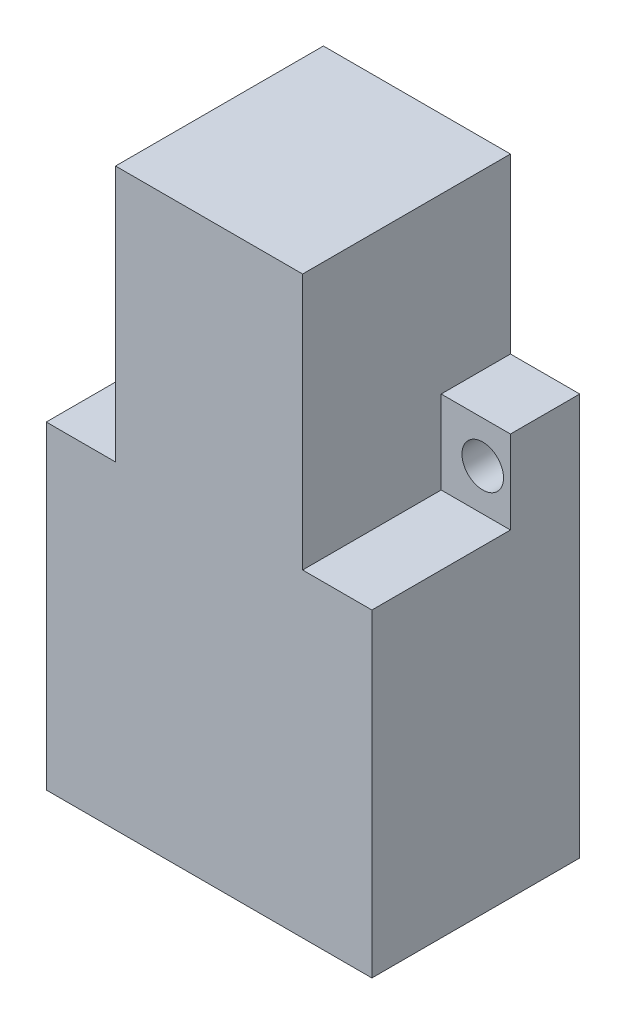
ISO-10303-21;
HEADER;
FILE_DESCRIPTION(('STEP AP214'),'2;1');
FILE_NAME('part.step','',(''),(''),'','','');
FILE_SCHEMA(('AUTOMOTIVE_DESIGN { 1 0 10303 214 1 1 1 1 }'));
ENDSEC;
DATA;
#1=APPLICATION_CONTEXT('core data for automotive mechanical design processes');
#2=APPLICATION_PROTOCOL_DEFINITION('international standard','automotive_design',2000,#1);
#3=PRODUCT_CONTEXT('',#1,'mechanical');
#4=PRODUCT('Part','Part','',(#3));
#5=PRODUCT_RELATED_PRODUCT_CATEGORY('part','',(#4));
#6=PRODUCT_DEFINITION_FORMATION('','',#4);
#7=PRODUCT_DEFINITION_CONTEXT('part definition',#1,'design');
#8=PRODUCT_DEFINITION('design','',#6,#7);
#9=PRODUCT_DEFINITION_SHAPE('','',#8);
#10=(LENGTH_UNIT() NAMED_UNIT(*) SI_UNIT(.MILLI.,.METRE.));
#11=(NAMED_UNIT(*) PLANE_ANGLE_UNIT() SI_UNIT($,.RADIAN.));
#12=(NAMED_UNIT(*) SI_UNIT($,.STERADIAN.) SOLID_ANGLE_UNIT());
#13=UNCERTAINTY_MEASURE_WITH_UNIT(LENGTH_MEASURE(1.E-05),#10,'distance_accuracy_value','');
#14=(GEOMETRIC_REPRESENTATION_CONTEXT(3) GLOBAL_UNCERTAINTY_ASSIGNED_CONTEXT((#13)) GLOBAL_UNIT_ASSIGNED_CONTEXT((#10,
#11,#12)) REPRESENTATION_CONTEXT('',''));
#15=CARTESIAN_POINT('',(0.,0.,0.));
#16=DIRECTION('',(0.,0.,1.));
#17=DIRECTION('',(1.,0.,0.));
#18=AXIS2_PLACEMENT_3D('',#15,#16,#17);
#19=CARTESIAN_POINT('',(11.75,20.75,15.));
#20=DIRECTION('',(-1.,0.,0.));
#21=DIRECTION('',(0.,-1.,0.));
#22=AXIS2_PLACEMENT_3D('',#19,#20,#21);
#23=PLANE('',#22);
#24=DIRECTION('',(0.,1.,0.));
#25=VECTOR('',#24,1.);
#26=CARTESIAN_POINT('',(11.75,20.75,0.));
#27=LINE('',#26,#25);
#28=CARTESIAN_POINT('',(11.75,-20.75,0.));
#29=VERTEX_POINT('',#28);
#30=CARTESIAN_POINT('',(11.75,8.25000000000001,0.));
#31=VERTEX_POINT('',#30);
#32=EDGE_CURVE('E148',#29,#31,#27,.T.);
#33=ORIENTED_EDGE('',*,*,#32,.T.);
#34=DIRECTION('',(0.,0.,1.));
#35=VECTOR('',#34,1.);
#36=CARTESIAN_POINT('',(11.75,8.25000000000001,0.));
#37=LINE('',#36,#35);
#38=CARTESIAN_POINT('',(11.75,8.25000000000001,5.));
#39=VERTEX_POINT('',#38);
#40=EDGE_CURVE('E224',#31,#39,#37,.T.);
#41=ORIENTED_EDGE('',*,*,#40,.T.);
#42=DIRECTION('',(0.,1.,0.));
#43=VECTOR('',#42,1.);
#44=CARTESIAN_POINT('',(11.75,20.75,5.));
#45=LINE('',#44,#43);
#46=CARTESIAN_POINT('',(11.75,2.25000000000001,5.));
#47=VERTEX_POINT('',#46);
#48=EDGE_CURVE('E181',#47,#39,#45,.T.);
#49=ORIENTED_EDGE('',*,*,#48,.F.);
#50=DIRECTION('',(0.,0.,1.));
#51=VECTOR('',#50,1.);
#52=CARTESIAN_POINT('',(11.75,2.25000000000001,5.));
#53=LINE('',#52,#51);
#54=CARTESIAN_POINT('',(11.75,2.25000000000001,15.));
#55=VERTEX_POINT('',#54);
#56=EDGE_CURVE('E195',#47,#55,#53,.T.);
#57=ORIENTED_EDGE('',*,*,#56,.T.);
#58=DIRECTION('',(0.,1.,0.));
#59=VECTOR('',#58,1.);
#60=CARTESIAN_POINT('',(11.75,20.75,15.));
#61=LINE('',#60,#59);
#62=CARTESIAN_POINT('',(11.75,-20.75,15.));
#63=VERTEX_POINT('',#62);
#64=EDGE_CURVE('E145',#63,#55,#61,.T.);
#65=ORIENTED_EDGE('',*,*,#64,.F.);
#66=DIRECTION('',(0.,0.,-1.));
#67=VECTOR('',#66,1.);
#68=CARTESIAN_POINT('',(11.75,-20.75,15.));
#69=LINE('',#68,#67);
#70=EDGE_CURVE('E41',#63,#29,#69,.T.);
#71=ORIENTED_EDGE('',*,*,#70,.T.);
#72=EDGE_LOOP('',(#33,#41,#49,#57,#65,#71));
#73=FACE_BOUND('',#72,.T.);
#74=ADVANCED_FACE('F34',(#73),#23,.F.);
#75=CARTESIAN_POINT('',(-11.75,20.75,15.));
#76=DIRECTION('',(0.,-1.,0.));
#77=DIRECTION('',(0.,0.,-1.));
#78=AXIS2_PLACEMENT_3D('',#75,#76,#77);
#79=PLANE('',#78);
#80=DIRECTION('',(-1.,0.,0.));
#81=VECTOR('',#80,1.);
#82=CARTESIAN_POINT('',(-11.75,20.75,0.));
#83=LINE('',#82,#81);
#84=CARTESIAN_POINT('',(6.75,20.75,0.));
#85=VERTEX_POINT('',#84);
#86=CARTESIAN_POINT('',(-6.75,20.75,0.));
#87=VERTEX_POINT('',#86);
#88=EDGE_CURVE('E143',#85,#87,#83,.T.);
#89=ORIENTED_EDGE('',*,*,#88,.T.);
#90=DIRECTION('',(0.,0.,1.));
#91=VECTOR('',#90,1.);
#92=CARTESIAN_POINT('',(-6.75,20.75,5.));
#93=LINE('',#92,#91);
#94=CARTESIAN_POINT('',(-6.75,20.75,15.));
#95=VERTEX_POINT('',#94);
#96=EDGE_CURVE('E165',#87,#95,#93,.T.);
#97=ORIENTED_EDGE('',*,*,#96,.T.);
#98=DIRECTION('',(-1.,0.,0.));
#99=VECTOR('',#98,1.);
#100=CARTESIAN_POINT('',(-11.75,20.75,15.));
#101=LINE('',#100,#99);
#102=CARTESIAN_POINT('',(6.75,20.75,15.));
#103=VERTEX_POINT('',#102);
#104=EDGE_CURVE('E162',#103,#95,#101,.T.);
#105=ORIENTED_EDGE('',*,*,#104,.F.);
#106=DIRECTION('',(0.,0.,1.));
#107=VECTOR('',#106,1.);
#108=CARTESIAN_POINT('',(6.75,20.75,5.));
#109=LINE('',#108,#107);
#110=EDGE_CURVE('E190',#85,#103,#109,.T.);
#111=ORIENTED_EDGE('',*,*,#110,.F.);
#112=EDGE_LOOP('',(#89,#97,#105,#111));
#113=FACE_BOUND('',#112,.T.);
#114=ADVANCED_FACE('F207',(#113),#79,.F.);
#115=CARTESIAN_POINT('',(-11.75,20.75,15.));
#116=DIRECTION('',(1.,0.,0.));
#117=DIRECTION('',(0.,0.,-1.));
#118=AXIS2_PLACEMENT_3D('',#115,#116,#117);
#119=PLANE('',#118);
#120=DIRECTION('',(0.,-1.,0.));
#121=VECTOR('',#120,1.);
#122=CARTESIAN_POINT('',(-11.75,20.75,5.));
#123=LINE('',#122,#121);
#124=CARTESIAN_POINT('',(-11.75,8.25000000000001,5.));
#125=VERTEX_POINT('',#124);
#126=CARTESIAN_POINT('',(-11.75,2.25000000000001,5.));
#127=VERTEX_POINT('',#126);
#128=EDGE_CURVE('E137',#125,#127,#123,.T.);
#129=ORIENTED_EDGE('',*,*,#128,.F.);
#130=DIRECTION('',(0.,0.,1.));
#131=VECTOR('',#130,1.);
#132=CARTESIAN_POINT('',(-11.75,8.25000000000001,0.));
#133=LINE('',#132,#131);
#134=CARTESIAN_POINT('',(-11.75,8.25000000000001,0.));
#135=VERTEX_POINT('',#134);
#136=EDGE_CURVE('E56',#135,#125,#133,.T.);
#137=ORIENTED_EDGE('',*,*,#136,.F.);
#138=DIRECTION('',(0.,-1.,0.));
#139=VECTOR('',#138,1.);
#140=CARTESIAN_POINT('',(-11.75,20.75,0.));
#141=LINE('',#140,#139);
#142=CARTESIAN_POINT('',(-11.75,-20.75,0.));
#143=VERTEX_POINT('',#142);
#144=EDGE_CURVE('E135',#135,#143,#141,.T.);
#145=ORIENTED_EDGE('',*,*,#144,.T.);
#146=DIRECTION('',(0.,0.,-1.));
#147=VECTOR('',#146,1.);
#148=CARTESIAN_POINT('',(-11.75,-20.75,15.));
#149=LINE('',#148,#147);
#150=CARTESIAN_POINT('',(-11.75,-20.75,15.));
#151=VERTEX_POINT('',#150);
#152=EDGE_CURVE('E11',#151,#143,#149,.T.);
#153=ORIENTED_EDGE('',*,*,#152,.F.);
#154=DIRECTION('',(0.,-1.,0.));
#155=VECTOR('',#154,1.);
#156=CARTESIAN_POINT('',(-11.75,20.75,15.));
#157=LINE('',#156,#155);
#158=CARTESIAN_POINT('',(-11.75,2.25000000000001,15.));
#159=VERTEX_POINT('',#158);
#160=EDGE_CURVE('E157',#159,#151,#157,.T.);
#161=ORIENTED_EDGE('',*,*,#160,.F.);
#162=DIRECTION('',(0.,0.,1.));
#163=VECTOR('',#162,1.);
#164=CARTESIAN_POINT('',(-11.75,2.25000000000001,5.));
#165=LINE('',#164,#163);
#166=EDGE_CURVE('E173',#127,#159,#165,.T.);
#167=ORIENTED_EDGE('',*,*,#166,.F.);
#168=EDGE_LOOP('',(#129,#137,#145,#153,#161,#167));
#169=FACE_BOUND('',#168,.T.);
#170=ADVANCED_FACE('F133',(#169),#119,.F.);
#171=CARTESIAN_POINT('',(-11.75,-20.75,15.));
#172=DIRECTION('',(0.,1.,0.));
#173=DIRECTION('',(0.,0.,1.));
#174=AXIS2_PLACEMENT_3D('',#171,#172,#173);
#175=PLANE('',#174);
#176=DIRECTION('',(1.,0.,0.));
#177=VECTOR('',#176,1.);
#178=CARTESIAN_POINT('',(-11.75,-20.75,0.));
#179=LINE('',#178,#177);
#180=EDGE_CURVE('E142',#143,#29,#179,.T.);
#181=ORIENTED_EDGE('',*,*,#180,.T.);
#182=ORIENTED_EDGE('',*,*,#70,.F.);
#183=DIRECTION('',(1.,0.,0.));
#184=VECTOR('',#183,1.);
#185=CARTESIAN_POINT('',(-11.75,-20.75,15.));
#186=LINE('',#185,#184);
#187=EDGE_CURVE('E152',#151,#63,#186,.T.);
#188=ORIENTED_EDGE('',*,*,#187,.F.);
#189=ORIENTED_EDGE('',*,*,#152,.T.);
#190=EDGE_LOOP('',(#181,#182,#188,#189));
#191=FACE_BOUND('',#190,.T.);
#192=ADVANCED_FACE('F245',(#191),#175,.F.);
#193=CARTESIAN_POINT('',(0.,0.,15.));
#194=DIRECTION('',(0.,0.,1.));
#195=DIRECTION('',(1.,0.,0.));
#196=AXIS2_PLACEMENT_3D('',#193,#194,#195);
#197=PLANE('',#196);
#198=DIRECTION('',(0.,1.,0.));
#199=VECTOR('',#198,1.);
#200=CARTESIAN_POINT('',(-6.75,20.75,15.));
#201=LINE('',#200,#199);
#202=CARTESIAN_POINT('',(-6.75,2.25000000000001,15.));
#203=VERTEX_POINT('',#202);
#204=EDGE_CURVE('E176',#203,#95,#201,.T.);
#205=ORIENTED_EDGE('',*,*,#204,.F.);
#206=DIRECTION('',(1.,0.,0.));
#207=VECTOR('',#206,1.);
#208=CARTESIAN_POINT('',(-11.75,2.25000000000001,15.));
#209=LINE('',#208,#207);
#210=EDGE_CURVE('E198',#159,#203,#209,.T.);
#211=ORIENTED_EDGE('',*,*,#210,.F.);
#212=ORIENTED_EDGE('',*,*,#160,.T.);
#213=ORIENTED_EDGE('',*,*,#187,.T.);
#214=ORIENTED_EDGE('',*,*,#64,.T.);
#215=DIRECTION('',(1.,0.,0.));
#216=VECTOR('',#215,1.);
#217=CARTESIAN_POINT('',(11.75,2.25000000000001,15.));
#218=LINE('',#217,#216);
#219=CARTESIAN_POINT('',(6.75,2.25000000000001,15.));
#220=VERTEX_POINT('',#219);
#221=EDGE_CURVE('E185',#220,#55,#218,.T.);
#222=ORIENTED_EDGE('',*,*,#221,.F.);
#223=DIRECTION('',(0.,-1.,0.));
#224=VECTOR('',#223,1.);
#225=CARTESIAN_POINT('',(6.75,20.75,15.));
#226=LINE('',#225,#224);
#227=EDGE_CURVE('E191',#103,#220,#226,.T.);
#228=ORIENTED_EDGE('',*,*,#227,.F.);
#229=ORIENTED_EDGE('',*,*,#104,.T.);
#230=EDGE_LOOP('',(#205,#211,#212,#213,#214,#222,#228,#229));
#231=FACE_BOUND('',#230,.T.);
#232=ADVANCED_FACE('F204',(#231),#197,.T.);
#233=CARTESIAN_POINT('',(0.,0.,0.));
#234=DIRECTION('',(0.,0.,1.));
#235=DIRECTION('',(1.,0.,0.));
#236=AXIS2_PLACEMENT_3D('',#233,#234,#235);
#237=PLANE('',#236);
#238=CARTESIAN_POINT('',(-9.75,5.25000000000001,0.));
#239=DIRECTION('',(0.,0.,1.));
#240=DIRECTION('',(1.,0.,0.));
#241=AXIS2_PLACEMENT_3D('',#238,#239,#240);
#242=CIRCLE('',#241,1.5);
#243=CARTESIAN_POINT('',(-8.25,5.25000000000001,0.));
#244=VERTEX_POINT('',#243);
#245=EDGE_CURVE('E228',#244,#244,#242,.T.);
#246=ORIENTED_EDGE('',*,*,#245,.T.);
#247=EDGE_LOOP('',(#246));
#248=FACE_BOUND('',#247,.T.);
#249=CARTESIAN_POINT('',(9.75,5.25000000000001,0.));
#250=DIRECTION('',(0.,0.,1.));
#251=DIRECTION('',(1.,0.,0.));
#252=AXIS2_PLACEMENT_3D('',#249,#250,#251);
#253=CIRCLE('',#252,1.5);
#254=CARTESIAN_POINT('',(11.25,5.25000000000001,0.));
#255=VERTEX_POINT('',#254);
#256=EDGE_CURVE('E301',#255,#255,#253,.T.);
#257=ORIENTED_EDGE('',*,*,#256,.T.);
#258=EDGE_LOOP('',(#257));
#259=FACE_BOUND('',#258,.T.);
#260=DIRECTION('',(1.,0.,0.));
#261=VECTOR('',#260,1.);
#262=CARTESIAN_POINT('',(-11.75,8.25000000000001,0.));
#263=LINE('',#262,#261);
#264=CARTESIAN_POINT('',(-6.75,8.25000000000001,0.));
#265=VERTEX_POINT('',#264);
#266=EDGE_CURVE('E121',#135,#265,#263,.T.);
#267=ORIENTED_EDGE('',*,*,#266,.T.);
#268=DIRECTION('',(0.,1.,0.));
#269=VECTOR('',#268,1.);
#270=CARTESIAN_POINT('',(-6.75,20.75,0.));
#271=LINE('',#270,#269);
#272=EDGE_CURVE('E128',#265,#87,#271,.T.);
#273=ORIENTED_EDGE('',*,*,#272,.T.);
#274=ORIENTED_EDGE('',*,*,#88,.F.);
#275=DIRECTION('',(0.,-1.,0.));
#276=VECTOR('',#275,1.);
#277=CARTESIAN_POINT('',(6.75,20.75,0.));
#278=LINE('',#277,#276);
#279=CARTESIAN_POINT('',(6.75,8.25000000000001,0.));
#280=VERTEX_POINT('',#279);
#281=EDGE_CURVE('E212',#85,#280,#278,.T.);
#282=ORIENTED_EDGE('',*,*,#281,.T.);
#283=DIRECTION('',(1.,0.,0.));
#284=VECTOR('',#283,1.);
#285=CARTESIAN_POINT('',(6.75,8.25000000000001,0.));
#286=LINE('',#285,#284);
#287=EDGE_CURVE('E216',#280,#31,#286,.T.);
#288=ORIENTED_EDGE('',*,*,#287,.T.);
#289=ORIENTED_EDGE('',*,*,#32,.F.);
#290=ORIENTED_EDGE('',*,*,#180,.F.);
#291=ORIENTED_EDGE('',*,*,#144,.F.);
#292=EDGE_LOOP('',(#267,#273,#274,#282,#288,#289,#290,#291));
#293=FACE_BOUND('',#292,.T.);
#294=ADVANCED_FACE('F140',(#248,#259,#293),#237,.F.);
#295=CARTESIAN_POINT('',(11.75,2.25000000000001,5.));
#296=DIRECTION('',(0.,-1.,0.));
#297=DIRECTION('',(0.,0.,-1.));
#298=AXIS2_PLACEMENT_3D('',#295,#296,#297);
#299=PLANE('',#298);
#300=ORIENTED_EDGE('',*,*,#221,.T.);
#301=ORIENTED_EDGE('',*,*,#56,.F.);
#302=DIRECTION('',(1.,0.,0.));
#303=VECTOR('',#302,1.);
#304=CARTESIAN_POINT('',(11.75,2.25000000000001,5.));
#305=LINE('',#304,#303);
#306=CARTESIAN_POINT('',(6.75,2.25000000000001,5.));
#307=VERTEX_POINT('',#306);
#308=EDGE_CURVE('E187',#307,#47,#305,.T.);
#309=ORIENTED_EDGE('',*,*,#308,.F.);
#310=DIRECTION('',(0.,0.,1.));
#311=VECTOR('',#310,1.);
#312=CARTESIAN_POINT('',(6.75,2.25000000000001,5.));
#313=LINE('',#312,#311);
#314=EDGE_CURVE('E199',#307,#220,#313,.T.);
#315=ORIENTED_EDGE('',*,*,#314,.T.);
#316=EDGE_LOOP('',(#300,#301,#309,#315));
#317=FACE_BOUND('',#316,.T.);
#318=ADVANCED_FACE('F248',(#317),#299,.F.);
#319=CARTESIAN_POINT('',(6.75,20.75,5.));
#320=DIRECTION('',(-1.,0.,0.));
#321=DIRECTION('',(0.,-1.,0.));
#322=AXIS2_PLACEMENT_3D('',#319,#320,#321);
#323=PLANE('',#322);
#324=ORIENTED_EDGE('',*,*,#227,.T.);
#325=ORIENTED_EDGE('',*,*,#314,.F.);
#326=DIRECTION('',(0.,-1.,0.));
#327=VECTOR('',#326,1.);
#328=CARTESIAN_POINT('',(6.75,20.75,5.));
#329=LINE('',#328,#327);
#330=CARTESIAN_POINT('',(6.75,8.25000000000001,5.));
#331=VERTEX_POINT('',#330);
#332=EDGE_CURVE('E184',#331,#307,#329,.T.);
#333=ORIENTED_EDGE('',*,*,#332,.F.);
#334=DIRECTION('',(0.,0.,1.));
#335=VECTOR('',#334,1.);
#336=CARTESIAN_POINT('',(6.75,8.25000000000001,0.));
#337=LINE('',#336,#335);
#338=EDGE_CURVE('E48',#280,#331,#337,.T.);
#339=ORIENTED_EDGE('',*,*,#338,.F.);
#340=ORIENTED_EDGE('',*,*,#281,.F.);
#341=ORIENTED_EDGE('',*,*,#110,.T.);
#342=EDGE_LOOP('',(#324,#325,#333,#339,#340,#341));
#343=FACE_BOUND('',#342,.T.);
#344=ADVANCED_FACE('F213',(#343),#323,.F.);
#345=CARTESIAN_POINT('',(0.,0.,5.));
#346=DIRECTION('',(0.,0.,-1.));
#347=DIRECTION('',(-1.,0.,0.));
#348=AXIS2_PLACEMENT_3D('',#345,#346,#347);
#349=PLANE('',#348);
#350=CARTESIAN_POINT('',(9.75,5.25000000000001,5.));
#351=DIRECTION('',(0.,0.,1.));
#352=DIRECTION('',(1.,0.,0.));
#353=AXIS2_PLACEMENT_3D('',#350,#351,#352);
#354=CIRCLE('',#353,1.5);
#355=CARTESIAN_POINT('',(11.25,5.25000000000001,5.));
#356=VERTEX_POINT('',#355);
#357=EDGE_CURVE('E306',#356,#356,#354,.T.);
#358=ORIENTED_EDGE('',*,*,#357,.F.);
#359=EDGE_LOOP('',(#358));
#360=FACE_BOUND('',#359,.T.);
#361=ORIENTED_EDGE('',*,*,#48,.T.);
#362=DIRECTION('',(1.,0.,0.));
#363=VECTOR('',#362,1.);
#364=CARTESIAN_POINT('',(6.75,8.25000000000001,5.));
#365=LINE('',#364,#363);
#366=EDGE_CURVE('E217',#331,#39,#365,.T.);
#367=ORIENTED_EDGE('',*,*,#366,.F.);
#368=ORIENTED_EDGE('',*,*,#332,.T.);
#369=ORIENTED_EDGE('',*,*,#308,.T.);
#370=EDGE_LOOP('',(#361,#367,#368,#369));
#371=FACE_BOUND('',#370,.T.);
#372=ADVANCED_FACE('F252',(#360,#371),#349,.F.);
#373=CARTESIAN_POINT('',(-6.75,20.75,5.));
#374=DIRECTION('',(1.,0.,0.));
#375=DIRECTION('',(0.,1.,0.));
#376=AXIS2_PLACEMENT_3D('',#373,#374,#375);
#377=PLANE('',#376);
#378=ORIENTED_EDGE('',*,*,#204,.T.);
#379=ORIENTED_EDGE('',*,*,#96,.F.);
#380=ORIENTED_EDGE('',*,*,#272,.F.);
#381=DIRECTION('',(0.,0.,1.));
#382=VECTOR('',#381,1.);
#383=CARTESIAN_POINT('',(-6.75,8.25000000000001,0.));
#384=LINE('',#383,#382);
#385=CARTESIAN_POINT('',(-6.75,8.25000000000001,5.));
#386=VERTEX_POINT('',#385);
#387=EDGE_CURVE('E123',#265,#386,#384,.T.);
#388=ORIENTED_EDGE('',*,*,#387,.T.);
#389=DIRECTION('',(0.,1.,0.));
#390=VECTOR('',#389,1.);
#391=CARTESIAN_POINT('',(-6.75,20.75,5.));
#392=LINE('',#391,#390);
#393=CARTESIAN_POINT('',(-6.75,2.25000000000001,5.));
#394=VERTEX_POINT('',#393);
#395=EDGE_CURVE('E180',#394,#386,#392,.T.);
#396=ORIENTED_EDGE('',*,*,#395,.F.);
#397=DIRECTION('',(0.,0.,1.));
#398=VECTOR('',#397,1.);
#399=CARTESIAN_POINT('',(-6.75,2.25000000000001,5.));
#400=LINE('',#399,#398);
#401=EDGE_CURVE('E168',#394,#203,#400,.T.);
#402=ORIENTED_EDGE('',*,*,#401,.T.);
#403=EDGE_LOOP('',(#378,#379,#380,#388,#396,#402));
#404=FACE_BOUND('',#403,.T.);
#405=ADVANCED_FACE('F238',(#404),#377,.F.);
#406=CARTESIAN_POINT('',(-11.75,2.25000000000001,5.));
#407=DIRECTION('',(0.,-1.,0.));
#408=DIRECTION('',(0.,0.,-1.));
#409=AXIS2_PLACEMENT_3D('',#406,#407,#408);
#410=PLANE('',#409);
#411=ORIENTED_EDGE('',*,*,#210,.T.);
#412=ORIENTED_EDGE('',*,*,#401,.F.);
#413=DIRECTION('',(1.,0.,0.));
#414=VECTOR('',#413,1.);
#415=CARTESIAN_POINT('',(-11.75,2.25000000000001,5.));
#416=LINE('',#415,#414);
#417=EDGE_CURVE('E232',#127,#394,#416,.T.);
#418=ORIENTED_EDGE('',*,*,#417,.F.);
#419=ORIENTED_EDGE('',*,*,#166,.T.);
#420=EDGE_LOOP('',(#411,#412,#418,#419));
#421=FACE_BOUND('',#420,.T.);
#422=ADVANCED_FACE('F241',(#421),#410,.F.);
#423=CARTESIAN_POINT('',(0.,0.,5.));
#424=DIRECTION('',(0.,0.,1.));
#425=DIRECTION('',(1.,0.,0.));
#426=AXIS2_PLACEMENT_3D('',#423,#424,#425);
#427=PLANE('',#426);
#428=CARTESIAN_POINT('',(-9.75,5.25000000000001,5.));
#429=DIRECTION('',(0.,0.,1.));
#430=DIRECTION('',(1.,0.,0.));
#431=AXIS2_PLACEMENT_3D('',#428,#429,#430);
#432=CIRCLE('',#431,1.5);
#433=CARTESIAN_POINT('',(-8.25,5.25000000000001,5.));
#434=VERTEX_POINT('',#433);
#435=EDGE_CURVE('E299',#434,#434,#432,.T.);
#436=ORIENTED_EDGE('',*,*,#435,.F.);
#437=EDGE_LOOP('',(#436));
#438=FACE_BOUND('',#437,.T.);
#439=DIRECTION('',(1.,0.,0.));
#440=VECTOR('',#439,1.);
#441=CARTESIAN_POINT('',(-11.75,8.25000000000001,5.));
#442=LINE('',#441,#440);
#443=EDGE_CURVE('E129',#125,#386,#442,.T.);
#444=ORIENTED_EDGE('',*,*,#443,.F.);
#445=ORIENTED_EDGE('',*,*,#128,.T.);
#446=ORIENTED_EDGE('',*,*,#417,.T.);
#447=ORIENTED_EDGE('',*,*,#395,.T.);
#448=EDGE_LOOP('',(#444,#445,#446,#447));
#449=FACE_BOUND('',#448,.T.);
#450=ADVANCED_FACE('F264',(#438,#449),#427,.T.);
#451=CARTESIAN_POINT('',(-11.75,8.25000000000001,0.));
#452=DIRECTION('',(0.,-1.,0.));
#453=DIRECTION('',(0.,0.,-1.));
#454=AXIS2_PLACEMENT_3D('',#451,#452,#453);
#455=PLANE('',#454);
#456=ORIENTED_EDGE('',*,*,#443,.T.);
#457=ORIENTED_EDGE('',*,*,#387,.F.);
#458=ORIENTED_EDGE('',*,*,#266,.F.);
#459=ORIENTED_EDGE('',*,*,#136,.T.);
#460=EDGE_LOOP('',(#456,#457,#458,#459));
#461=FACE_BOUND('',#460,.T.);
#462=ADVANCED_FACE('F122',(#461),#455,.F.);
#463=CARTESIAN_POINT('',(6.75,8.25000000000001,0.));
#464=DIRECTION('',(0.,-1.,0.));
#465=DIRECTION('',(0.,0.,-1.));
#466=AXIS2_PLACEMENT_3D('',#463,#464,#465);
#467=PLANE('',#466);
#468=ORIENTED_EDGE('',*,*,#366,.T.);
#469=ORIENTED_EDGE('',*,*,#40,.F.);
#470=ORIENTED_EDGE('',*,*,#287,.F.);
#471=ORIENTED_EDGE('',*,*,#338,.T.);
#472=EDGE_LOOP('',(#468,#469,#470,#471));
#473=FACE_BOUND('',#472,.T.);
#474=ADVANCED_FACE('F253',(#473),#467,.F.);
#475=CARTESIAN_POINT('',(-9.75,5.25000000000001,0.));
#476=DIRECTION('',(0.,0.,1.));
#477=DIRECTION('',(1.,0.,0.));
#478=AXIS2_PLACEMENT_3D('',#475,#476,#477);
#479=CYLINDRICAL_SURFACE('',#478,1.5);
#480=ORIENTED_EDGE('',*,*,#245,.F.);
#481=EDGE_LOOP('',(#480));
#482=FACE_BOUND('',#481,.T.);
#483=ORIENTED_EDGE('',*,*,#435,.T.);
#484=EDGE_LOOP('',(#483));
#485=FACE_BOUND('',#484,.T.);
#486=ADVANCED_FACE('F255',(#482,#485),#479,.F.);
#487=CARTESIAN_POINT('',(9.75,5.25000000000001,0.));
#488=DIRECTION('',(0.,0.,1.));
#489=DIRECTION('',(1.,0.,0.));
#490=AXIS2_PLACEMENT_3D('',#487,#488,#489);
#491=CYLINDRICAL_SURFACE('',#490,1.5);
#492=ORIENTED_EDGE('',*,*,#256,.F.);
#493=EDGE_LOOP('',(#492));
#494=FACE_BOUND('',#493,.T.);
#495=ORIENTED_EDGE('',*,*,#357,.T.);
#496=EDGE_LOOP('',(#495));
#497=FACE_BOUND('',#496,.T.);
#498=ADVANCED_FACE('F261',(#494,#497),#491,.F.);
#499=CLOSED_SHELL('',(#74,#114,#170,#192,#232,#294,#318,#344,#372,#405,#422,#450,#462,#474,#486,#498));
#500=MANIFOLD_SOLID_BREP('B2',#499);
#501=ADVANCED_BREP_SHAPE_REPRESENTATION('',(#18,#500),#14);
#502=SHAPE_DEFINITION_REPRESENTATION(#9,#501);
ENDSEC;
END-ISO-10303-21;
